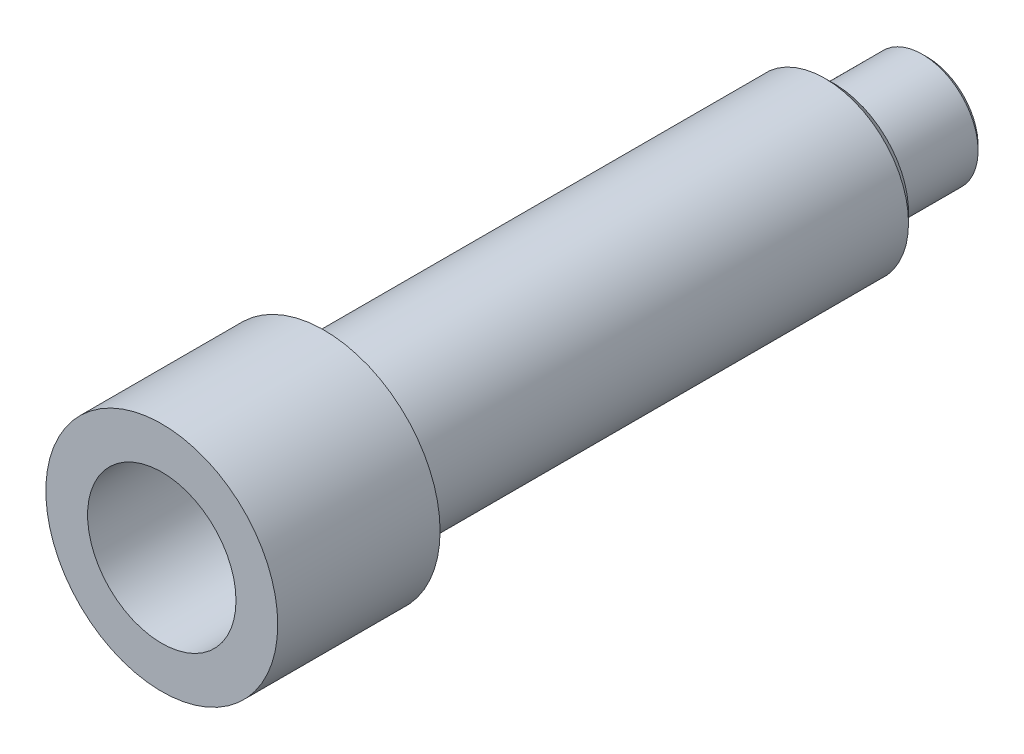
ISO-10303-21;
HEADER;
FILE_DESCRIPTION(('STEP AP214'),'2;1');
FILE_NAME('part.step','',(''),(''),'','','');
FILE_SCHEMA(('AUTOMOTIVE_DESIGN { 1 0 10303 214 1 1 1 1 }'));
ENDSEC;
DATA;
#1=APPLICATION_CONTEXT('core data for automotive mechanical design processes');
#2=APPLICATION_PROTOCOL_DEFINITION('international standard','automotive_design',2000,#1);
#3=PRODUCT_CONTEXT('',#1,'mechanical');
#4=PRODUCT('Part','Part','',(#3));
#5=PRODUCT_RELATED_PRODUCT_CATEGORY('part','',(#4));
#6=PRODUCT_DEFINITION_FORMATION('','',#4);
#7=PRODUCT_DEFINITION_CONTEXT('part definition',#1,'design');
#8=PRODUCT_DEFINITION('design','',#6,#7);
#9=PRODUCT_DEFINITION_SHAPE('','',#8);
#10=(LENGTH_UNIT() NAMED_UNIT(*) SI_UNIT(.MILLI.,.METRE.));
#11=(NAMED_UNIT(*) PLANE_ANGLE_UNIT() SI_UNIT($,.RADIAN.));
#12=(NAMED_UNIT(*) SI_UNIT($,.STERADIAN.) SOLID_ANGLE_UNIT());
#13=UNCERTAINTY_MEASURE_WITH_UNIT(LENGTH_MEASURE(1.E-05),#10,'distance_accuracy_value','');
#14=(GEOMETRIC_REPRESENTATION_CONTEXT(3) GLOBAL_UNCERTAINTY_ASSIGNED_CONTEXT((#13)) GLOBAL_UNIT_ASSIGNED_CONTEXT((#10,
#11,#12)) REPRESENTATION_CONTEXT('',''));
#15=CARTESIAN_POINT('',(0.,0.,0.));
#16=DIRECTION('',(0.,0.,1.));
#17=DIRECTION('',(1.,0.,0.));
#18=AXIS2_PLACEMENT_3D('',#15,#16,#17);
#19=CARTESIAN_POINT('',(0.,0.,74.));
#20=DIRECTION('',(0.,0.,-1.));
#21=DIRECTION('',(-1.,0.,0.));
#22=AXIS2_PLACEMENT_3D('',#19,#20,#21);
#23=CYLINDRICAL_SURFACE('',#22,5.);
#24=CARTESIAN_POINT('',(0.,0.,-65.));
#25=DIRECTION('',(0.,0.,-1.));
#26=DIRECTION('',(-1.,0.,0.));
#27=AXIS2_PLACEMENT_3D('',#24,#25,#26);
#28=CIRCLE('',#27,5.);
#29=CARTESIAN_POINT('',(-5.,0.,-65.));
#30=VERTEX_POINT('',#29);
#31=EDGE_CURVE('E62',#30,#30,#28,.T.);
#32=ORIENTED_EDGE('',*,*,#31,.T.);
#33=EDGE_LOOP('',(#32));
#34=FACE_BOUND('',#33,.T.);
#35=CARTESIAN_POINT('',(0.,0.,5.50000000000001));
#36=DIRECTION('',(0.,0.,1.));
#37=DIRECTION('',(1.,0.,0.));
#38=AXIS2_PLACEMENT_3D('',#35,#36,#37);
#39=CIRCLE('',#38,5.);
#40=CARTESIAN_POINT('',(5.,0.,5.50000000000001));
#41=VERTEX_POINT('',#40);
#42=EDGE_CURVE('E34',#41,#41,#39,.F.);
#43=ORIENTED_EDGE('',*,*,#42,.F.);
#44=EDGE_LOOP('',(#43));
#45=FACE_BOUND('',#44,.T.);
#46=ADVANCED_FACE('F30',(#34,#45),#23,.F.);
#47=CARTESIAN_POINT('',(0.,0.,-55.));
#48=DIRECTION('',(0.,0.,-1.));
#49=DIRECTION('',(-1.,0.,0.));
#50=AXIS2_PLACEMENT_3D('',#47,#48,#49);
#51=PLANE('',#50);
#52=CARTESIAN_POINT('',(0.,0.,-55.));
#53=DIRECTION('',(0.,0.,-1.));
#54=DIRECTION('',(-1.,0.,0.));
#55=AXIS2_PLACEMENT_3D('',#52,#53,#54);
#56=CIRCLE('',#55,8.00000000000001);
#57=CARTESIAN_POINT('',(-8.00000000000001,0.,-55.));
#58=VERTEX_POINT('',#57);
#59=EDGE_CURVE('E38',#58,#58,#56,.T.);
#60=ORIENTED_EDGE('',*,*,#59,.T.);
#61=EDGE_LOOP('',(#60));
#62=FACE_BOUND('',#61,.T.);
#63=CARTESIAN_POINT('',(0.,0.,-55.));
#64=DIRECTION('',(0.,0.,-1.));
#65=DIRECTION('',(-1.,0.,0.));
#66=AXIS2_PLACEMENT_3D('',#63,#64,#65);
#67=CIRCLE('',#66,6.);
#68=CARTESIAN_POINT('',(-6.,0.,-55.));
#69=VERTEX_POINT('',#68);
#70=EDGE_CURVE('E57',#69,#69,#67,.T.);
#71=ORIENTED_EDGE('',*,*,#70,.F.);
#72=EDGE_LOOP('',(#71));
#73=FACE_BOUND('',#72,.T.);
#74=ADVANCED_FACE('F78',(#62,#73),#51,.T.);
#75=CARTESIAN_POINT('',(0.,0.,0.));
#76=DIRECTION('',(0.,0.,1.));
#77=DIRECTION('',(1.,0.,0.));
#78=AXIS2_PLACEMENT_3D('',#75,#76,#77);
#79=PLANE('',#78);
#80=CARTESIAN_POINT('',(0.,0.,0.));
#81=DIRECTION('',(0.,0.,1.));
#82=DIRECTION('',(1.,0.,0.));
#83=AXIS2_PLACEMENT_3D('',#80,#81,#82);
#84=CIRCLE('',#83,12.5);
#85=CARTESIAN_POINT('',(12.5,0.,0.));
#86=VERTEX_POINT('',#85);
#87=EDGE_CURVE('E54',#86,#86,#84,.T.);
#88=ORIENTED_EDGE('',*,*,#87,.F.);
#89=EDGE_LOOP('',(#88));
#90=FACE_BOUND('',#89,.T.);
#91=CARTESIAN_POINT('',(0.,0.,0.));
#92=DIRECTION('',(0.,0.,1.));
#93=DIRECTION('',(1.,0.,0.));
#94=AXIS2_PLACEMENT_3D('',#91,#92,#93);
#95=CIRCLE('',#94,9.);
#96=CARTESIAN_POINT('',(9.,0.,0.));
#97=VERTEX_POINT('',#96);
#98=EDGE_CURVE('E50',#97,#97,#95,.F.);
#99=ORIENTED_EDGE('',*,*,#98,.F.);
#100=EDGE_LOOP('',(#99));
#101=FACE_BOUND('',#100,.T.);
#102=ADVANCED_FACE('F84',(#90,#101),#79,.F.);
#103=CARTESIAN_POINT('',(0.,0.,17.5));
#104=DIRECTION('',(0.,0.,-1.));
#105=DIRECTION('',(-1.,0.,0.));
#106=AXIS2_PLACEMENT_3D('',#103,#104,#105);
#107=CYLINDRICAL_SURFACE('',#106,12.5);
#108=CARTESIAN_POINT('',(0.,0.,17.5));
#109=DIRECTION('',(0.,0.,1.));
#110=DIRECTION('',(1.,0.,0.));
#111=AXIS2_PLACEMENT_3D('',#108,#109,#110);
#112=CIRCLE('',#111,12.5);
#113=CARTESIAN_POINT('',(12.5,0.,17.5));
#114=VERTEX_POINT('',#113);
#115=EDGE_CURVE('E53',#114,#114,#112,.T.);
#116=ORIENTED_EDGE('',*,*,#115,.F.);
#117=EDGE_LOOP('',(#116));
#118=FACE_BOUND('',#117,.T.);
#119=ORIENTED_EDGE('',*,*,#87,.T.);
#120=EDGE_LOOP('',(#119));
#121=FACE_BOUND('',#120,.T.);
#122=ADVANCED_FACE('F106',(#118,#121),#107,.T.);
#123=CARTESIAN_POINT('',(0.,0.,17.5));
#124=DIRECTION('',(0.,0.,1.));
#125=DIRECTION('',(1.,0.,0.));
#126=AXIS2_PLACEMENT_3D('',#123,#124,#125);
#127=PLANE('',#126);
#128=CARTESIAN_POINT('',(0.,0.,17.5));
#129=DIRECTION('',(0.,0.,1.));
#130=DIRECTION('',(1.,0.,0.));
#131=AXIS2_PLACEMENT_3D('',#128,#129,#130);
#132=CIRCLE('',#131,8.);
#133=CARTESIAN_POINT('',(8.,0.,17.5));
#134=VERTEX_POINT('',#133);
#135=EDGE_CURVE('E65',#134,#134,#132,.T.);
#136=ORIENTED_EDGE('',*,*,#135,.F.);
#137=EDGE_LOOP('',(#136));
#138=FACE_BOUND('',#137,.T.);
#139=ORIENTED_EDGE('',*,*,#115,.T.);
#140=EDGE_LOOP('',(#139));
#141=FACE_BOUND('',#140,.T.);
#142=ADVANCED_FACE('F103',(#138,#141),#127,.T.);
#143=CARTESIAN_POINT('',(0.,0.,-55.));
#144=DIRECTION('',(0.,0.,1.));
#145=DIRECTION('',(1.,0.,0.));
#146=AXIS2_PLACEMENT_3D('',#143,#144,#145);
#147=CYLINDRICAL_SURFACE('',#146,9.);
#148=CARTESIAN_POINT('',(0.,0.,-54.));
#149=DIRECTION('',(0.,0.,-1.));
#150=DIRECTION('',(-1.,0.,0.));
#151=AXIS2_PLACEMENT_3D('',#148,#149,#150);
#152=CIRCLE('',#151,9.);
#153=CARTESIAN_POINT('',(-9.,0.,-54.));
#154=VERTEX_POINT('',#153);
#155=EDGE_CURVE('E10',#154,#154,#152,.F.);
#156=ORIENTED_EDGE('',*,*,#155,.T.);
#157=EDGE_LOOP('',(#156));
#158=FACE_BOUND('',#157,.T.);
#159=ORIENTED_EDGE('',*,*,#98,.T.);
#160=EDGE_LOOP('',(#159));
#161=FACE_BOUND('',#160,.T.);
#162=ADVANCED_FACE('F98',(#158,#161),#147,.T.);
#163=CARTESIAN_POINT('',(0.,0.,-65.));
#164=DIRECTION('',(0.,0.,1.));
#165=DIRECTION('',(1.,0.,0.));
#166=AXIS2_PLACEMENT_3D('',#163,#164,#165);
#167=CYLINDRICAL_SURFACE('',#166,6.);
#168=CARTESIAN_POINT('',(0.,0.,-64.5));
#169=DIRECTION('',(0.,0.,-1.));
#170=DIRECTION('',(-1.,0.,0.));
#171=AXIS2_PLACEMENT_3D('',#168,#169,#170);
#172=CIRCLE('',#171,6.);
#173=CARTESIAN_POINT('',(-6.,0.,-64.5));
#174=VERTEX_POINT('',#173);
#175=EDGE_CURVE('E42',#174,#174,#172,.F.);
#176=ORIENTED_EDGE('',*,*,#175,.T.);
#177=EDGE_LOOP('',(#176));
#178=FACE_BOUND('',#177,.T.);
#179=ORIENTED_EDGE('',*,*,#70,.T.);
#180=EDGE_LOOP('',(#179));
#181=FACE_BOUND('',#180,.T.);
#182=ADVANCED_FACE('F95',(#178,#181),#167,.T.);
#183=CARTESIAN_POINT('',(0.,0.,-65.));
#184=DIRECTION('',(0.,0.,-1.));
#185=DIRECTION('',(-1.,0.,0.));
#186=AXIS2_PLACEMENT_3D('',#183,#184,#185);
#187=PLANE('',#186);
#188=ORIENTED_EDGE('',*,*,#31,.F.);
#189=EDGE_LOOP('',(#188));
#190=FACE_BOUND('',#189,.T.);
#191=CARTESIAN_POINT('',(0.,0.,-65.));
#192=DIRECTION('',(0.,0.,-1.));
#193=DIRECTION('',(-1.,0.,0.));
#194=AXIS2_PLACEMENT_3D('',#191,#192,#193);
#195=CIRCLE('',#194,5.50000000000001);
#196=CARTESIAN_POINT('',(-5.50000000000001,0.,-65.));
#197=VERTEX_POINT('',#196);
#198=EDGE_CURVE('E47',#197,#197,#195,.T.);
#199=ORIENTED_EDGE('',*,*,#198,.T.);
#200=EDGE_LOOP('',(#199));
#201=FACE_BOUND('',#200,.T.);
#202=ADVANCED_FACE('F91',(#190,#201),#187,.T.);
#203=CARTESIAN_POINT('',(0.,0.,-65.));
#204=DIRECTION('',(0.,0.,1.));
#205=DIRECTION('',(1.,0.,0.));
#206=AXIS2_PLACEMENT_3D('',#203,#204,#205);
#207=CONICAL_SURFACE('',#206,5.50000000000001,0.785398163397444);
#208=ORIENTED_EDGE('',*,*,#175,.F.);
#209=EDGE_LOOP('',(#208));
#210=FACE_BOUND('',#209,.T.);
#211=ORIENTED_EDGE('',*,*,#198,.F.);
#212=EDGE_LOOP('',(#211));
#213=FACE_BOUND('',#212,.T.);
#214=ADVANCED_FACE('F94',(#210,#213),#207,.T.);
#215=CARTESIAN_POINT('',(0.,0.,-55.));
#216=DIRECTION('',(0.,0.,1.));
#217=DIRECTION('',(1.,0.,0.));
#218=AXIS2_PLACEMENT_3D('',#215,#216,#217);
#219=CONICAL_SURFACE('',#218,8.00000000000001,0.785398163397444);
#220=ORIENTED_EDGE('',*,*,#155,.F.);
#221=EDGE_LOOP('',(#220));
#222=FACE_BOUND('',#221,.T.);
#223=ORIENTED_EDGE('',*,*,#59,.F.);
#224=EDGE_LOOP('',(#223));
#225=FACE_BOUND('',#224,.T.);
#226=ADVANCED_FACE('F32',(#222,#225),#219,.T.);
#227=CARTESIAN_POINT('',(0.,0.,5.5));
#228=DIRECTION('',(0.,0.,1.));
#229=DIRECTION('',(1.,0.,0.));
#230=AXIS2_PLACEMENT_3D('',#227,#228,#229);
#231=PLANE('',#230);
#232=CARTESIAN_POINT('',(0.,0.,5.5));
#233=DIRECTION('',(0.,0.,1.));
#234=DIRECTION('',(1.,0.,0.));
#235=AXIS2_PLACEMENT_3D('',#232,#233,#234);
#236=CIRCLE('',#235,8.);
#237=CARTESIAN_POINT('',(8.,0.,5.5));
#238=VERTEX_POINT('',#237);
#239=EDGE_CURVE('E68',#238,#238,#236,.T.);
#240=ORIENTED_EDGE('',*,*,#239,.T.);
#241=EDGE_LOOP('',(#240));
#242=FACE_BOUND('',#241,.T.);
#243=ORIENTED_EDGE('',*,*,#42,.T.);
#244=EDGE_LOOP('',(#243));
#245=FACE_BOUND('',#244,.T.);
#246=ADVANCED_FACE('F75',(#242,#245),#231,.T.);
#247=CARTESIAN_POINT('',(0.,0.,5.5));
#248=DIRECTION('',(0.,0.,1.));
#249=DIRECTION('',(1.,0.,0.));
#250=AXIS2_PLACEMENT_3D('',#247,#248,#249);
#251=CYLINDRICAL_SURFACE('',#250,8.);
#252=ORIENTED_EDGE('',*,*,#239,.F.);
#253=EDGE_LOOP('',(#252));
#254=FACE_BOUND('',#253,.T.);
#255=ORIENTED_EDGE('',*,*,#135,.T.);
#256=EDGE_LOOP('',(#255));
#257=FACE_BOUND('',#256,.T.);
#258=ADVANCED_FACE('F89',(#254,#257),#251,.F.);
#259=CLOSED_SHELL('',(#46,#74,#102,#122,#142,#162,#182,#202,#214,#226,#246,#258));
#260=MANIFOLD_SOLID_BREP('B2',#259);
#261=ADVANCED_BREP_SHAPE_REPRESENTATION('',(#18,#260),#14);
#262=SHAPE_DEFINITION_REPRESENTATION(#9,#261);
ENDSEC;
END-ISO-10303-21;
